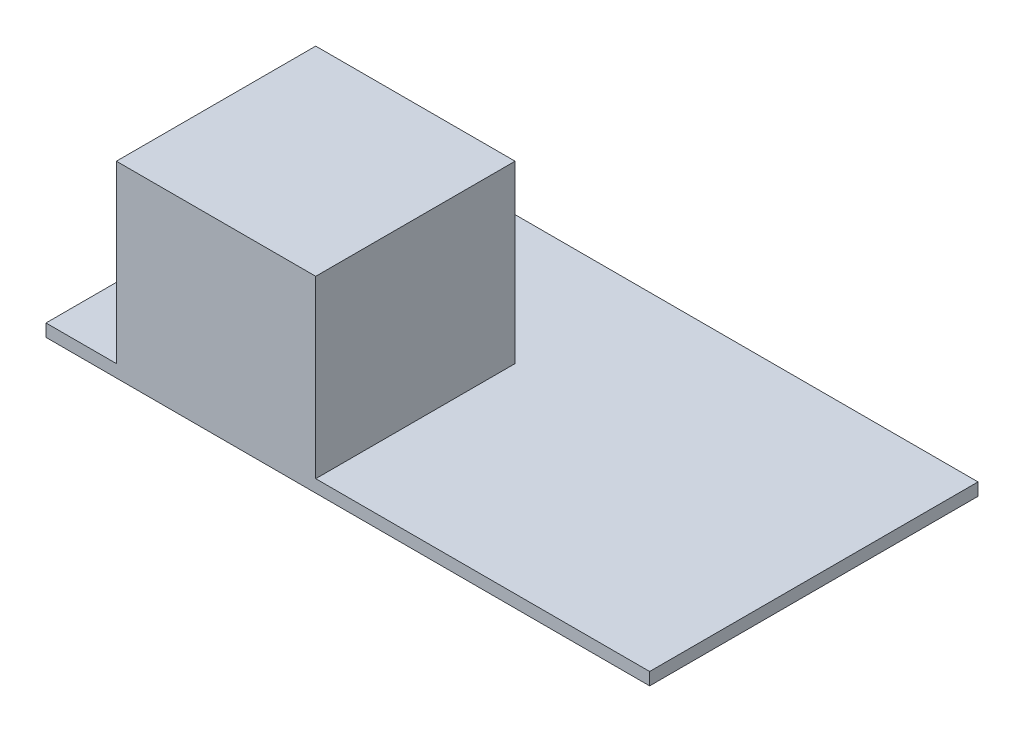
ISO-10303-21;
HEADER;
FILE_DESCRIPTION(('STEP AP214'),'2;1');
FILE_NAME('part.step','',(''),(''),'','','');
FILE_SCHEMA(('AUTOMOTIVE_DESIGN { 1 0 10303 214 1 1 1 1 }'));
ENDSEC;
DATA;
#1=APPLICATION_CONTEXT('core data for automotive mechanical design processes');
#2=APPLICATION_PROTOCOL_DEFINITION('international standard','automotive_design',2000,#1);
#3=PRODUCT_CONTEXT('',#1,'mechanical');
#4=PRODUCT('Part','Part','',(#3));
#5=PRODUCT_RELATED_PRODUCT_CATEGORY('part','',(#4));
#6=PRODUCT_DEFINITION_FORMATION('','',#4);
#7=PRODUCT_DEFINITION_CONTEXT('part definition',#1,'design');
#8=PRODUCT_DEFINITION('design','',#6,#7);
#9=PRODUCT_DEFINITION_SHAPE('','',#8);
#10=(LENGTH_UNIT() NAMED_UNIT(*) SI_UNIT(.MILLI.,.METRE.));
#11=(NAMED_UNIT(*) PLANE_ANGLE_UNIT() SI_UNIT($,.RADIAN.));
#12=(NAMED_UNIT(*) SI_UNIT($,.STERADIAN.) SOLID_ANGLE_UNIT());
#13=UNCERTAINTY_MEASURE_WITH_UNIT(LENGTH_MEASURE(1.E-05),#10,'distance_accuracy_value','');
#14=(GEOMETRIC_REPRESENTATION_CONTEXT(3) GLOBAL_UNCERTAINTY_ASSIGNED_CONTEXT((#13)) GLOBAL_UNIT_ASSIGNED_CONTEXT((#10,
#11,#12)) REPRESENTATION_CONTEXT('',''));
#15=CARTESIAN_POINT('',(0.,0.,0.));
#16=DIRECTION('',(0.,0.,1.));
#17=DIRECTION('',(1.,0.,0.));
#18=AXIS2_PLACEMENT_3D('',#15,#16,#17);
#19=CARTESIAN_POINT('',(38.605,1.6,-21.));
#20=DIRECTION('',(-1.,0.,0.));
#21=DIRECTION('',(0.,0.,1.));
#22=AXIS2_PLACEMENT_3D('',#19,#20,#21);
#23=PLANE('',#22);
#24=DIRECTION('',(0.,0.,-1.));
#25=VECTOR('',#24,1.);
#26=CARTESIAN_POINT('',(38.605,0.,-21.));
#27=LINE('',#26,#25);
#28=CARTESIAN_POINT('',(38.605,0.,21.));
#29=VERTEX_POINT('',#28);
#30=CARTESIAN_POINT('',(38.605,0.,-21.));
#31=VERTEX_POINT('',#30);
#32=EDGE_CURVE('E119',#29,#31,#27,.T.);
#33=ORIENTED_EDGE('',*,*,#32,.T.);
#34=DIRECTION('',(0.,-1.,0.));
#35=VECTOR('',#34,1.);
#36=CARTESIAN_POINT('',(38.605,1.6,-21.));
#37=LINE('',#36,#35);
#38=CARTESIAN_POINT('',(38.605,1.6,-21.));
#39=VERTEX_POINT('',#38);
#40=EDGE_CURVE('E11',#39,#31,#37,.T.);
#41=ORIENTED_EDGE('',*,*,#40,.F.);
#42=DIRECTION('',(0.,0.,-1.));
#43=VECTOR('',#42,1.);
#44=CARTESIAN_POINT('',(38.605,1.6,-21.));
#45=LINE('',#44,#43);
#46=CARTESIAN_POINT('',(38.605,1.6,21.));
#47=VERTEX_POINT('',#46);
#48=EDGE_CURVE('E128',#47,#39,#45,.T.);
#49=ORIENTED_EDGE('',*,*,#48,.F.);
#50=DIRECTION('',(0.,-1.,0.));
#51=VECTOR('',#50,1.);
#52=CARTESIAN_POINT('',(38.605,1.6,21.));
#53=LINE('',#52,#51);
#54=EDGE_CURVE('E138',#47,#29,#53,.T.);
#55=ORIENTED_EDGE('',*,*,#54,.T.);
#56=EDGE_LOOP('',(#33,#41,#49,#55));
#57=FACE_BOUND('',#56,.T.);
#58=ADVANCED_FACE('F33',(#57),#23,.F.);
#59=CARTESIAN_POINT('',(-38.605,1.6,-21.));
#60=DIRECTION('',(0.,0.,1.));
#61=DIRECTION('',(1.,0.,0.));
#62=AXIS2_PLACEMENT_3D('',#59,#60,#61);
#63=PLANE('',#62);
#64=DIRECTION('',(-1.,0.,0.));
#65=VECTOR('',#64,1.);
#66=CARTESIAN_POINT('',(-38.605,0.,-21.));
#67=LINE('',#66,#65);
#68=CARTESIAN_POINT('',(-38.605,0.,-21.));
#69=VERTEX_POINT('',#68);
#70=EDGE_CURVE('E122',#31,#69,#67,.T.);
#71=ORIENTED_EDGE('',*,*,#70,.T.);
#72=DIRECTION('',(0.,-1.,0.));
#73=VECTOR('',#72,1.);
#74=CARTESIAN_POINT('',(-38.605,1.6,-21.));
#75=LINE('',#74,#73);
#76=CARTESIAN_POINT('',(-38.605,1.6,-21.));
#77=VERTEX_POINT('',#76);
#78=EDGE_CURVE('E40',#77,#69,#75,.T.);
#79=ORIENTED_EDGE('',*,*,#78,.F.);
#80=DIRECTION('',(-1.,0.,0.));
#81=VECTOR('',#80,1.);
#82=CARTESIAN_POINT('',(-38.605,1.6,-21.));
#83=LINE('',#82,#81);
#84=EDGE_CURVE('E131',#39,#77,#83,.T.);
#85=ORIENTED_EDGE('',*,*,#84,.F.);
#86=ORIENTED_EDGE('',*,*,#40,.T.);
#87=EDGE_LOOP('',(#71,#79,#85,#86));
#88=FACE_BOUND('',#87,.T.);
#89=ADVANCED_FACE('F187',(#88),#63,.F.);
#90=CARTESIAN_POINT('',(-38.605,1.6,-21.));
#91=DIRECTION('',(1.,0.,0.));
#92=DIRECTION('',(0.,0.,-1.));
#93=AXIS2_PLACEMENT_3D('',#90,#91,#92);
#94=PLANE('',#93);
#95=DIRECTION('',(0.,0.,1.));
#96=VECTOR('',#95,1.);
#97=CARTESIAN_POINT('',(-38.605,0.,-21.));
#98=LINE('',#97,#96);
#99=CARTESIAN_POINT('',(-38.605,0.,21.));
#100=VERTEX_POINT('',#99);
#101=EDGE_CURVE('E141',#69,#100,#98,.T.);
#102=ORIENTED_EDGE('',*,*,#101,.T.);
#103=DIRECTION('',(0.,-1.,0.));
#104=VECTOR('',#103,1.);
#105=CARTESIAN_POINT('',(-38.605,1.6,21.));
#106=LINE('',#105,#104);
#107=CARTESIAN_POINT('',(-38.605,1.6,21.));
#108=VERTEX_POINT('',#107);
#109=EDGE_CURVE('E146',#108,#100,#106,.T.);
#110=ORIENTED_EDGE('',*,*,#109,.F.);
#111=DIRECTION('',(0.,0.,1.));
#112=VECTOR('',#111,1.);
#113=CARTESIAN_POINT('',(-38.605,1.6,-21.));
#114=LINE('',#113,#112);
#115=EDGE_CURVE('E134',#77,#108,#114,.T.);
#116=ORIENTED_EDGE('',*,*,#115,.F.);
#117=ORIENTED_EDGE('',*,*,#78,.T.);
#118=EDGE_LOOP('',(#102,#110,#116,#117));
#119=FACE_BOUND('',#118,.T.);
#120=ADVANCED_FACE('F153',(#119),#94,.F.);
#121=CARTESIAN_POINT('',(-38.605,1.6,21.));
#122=DIRECTION('',(0.,0.,-1.));
#123=DIRECTION('',(-1.,0.,0.));
#124=AXIS2_PLACEMENT_3D('',#121,#122,#123);
#125=PLANE('',#124);
#126=DIRECTION('',(1.,0.,0.));
#127=VECTOR('',#126,1.);
#128=CARTESIAN_POINT('',(-38.605,0.,21.));
#129=LINE('',#128,#127);
#130=EDGE_CURVE('E132',#100,#29,#129,.T.);
#131=ORIENTED_EDGE('',*,*,#130,.T.);
#132=ORIENTED_EDGE('',*,*,#54,.F.);
#133=DIRECTION('',(1.,0.,0.));
#134=VECTOR('',#133,1.);
#135=CARTESIAN_POINT('',(-38.605,1.6,21.));
#136=LINE('',#135,#134);
#137=CARTESIAN_POINT('',(-4.105,1.6,21.));
#138=VERTEX_POINT('',#137);
#139=EDGE_CURVE('E136',#138,#47,#136,.T.);
#140=ORIENTED_EDGE('',*,*,#139,.F.);
#141=DIRECTION('',(0.,-1.,0.));
#142=VECTOR('',#141,1.);
#143=CARTESIAN_POINT('',(-4.10499999999999,24.02,21.));
#144=LINE('',#143,#142);
#145=CARTESIAN_POINT('',(-4.10499999999999,24.02,21.));
#146=VERTEX_POINT('',#145);
#147=EDGE_CURVE('E103',#146,#138,#144,.T.);
#148=ORIENTED_EDGE('',*,*,#147,.F.);
#149=DIRECTION('',(1.,0.,0.));
#150=VECTOR('',#149,1.);
#151=CARTESIAN_POINT('',(-29.605,24.02,21.));
#152=LINE('',#151,#150);
#153=CARTESIAN_POINT('',(-29.605,24.02,21.));
#154=VERTEX_POINT('',#153);
#155=EDGE_CURVE('E96',#154,#146,#152,.T.);
#156=ORIENTED_EDGE('',*,*,#155,.F.);
#157=DIRECTION('',(0.,-1.,0.));
#158=VECTOR('',#157,1.);
#159=CARTESIAN_POINT('',(-29.605,24.02,21.));
#160=LINE('',#159,#158);
#161=CARTESIAN_POINT('',(-29.605,1.6,21.));
#162=VERTEX_POINT('',#161);
#163=EDGE_CURVE('E101',#154,#162,#160,.T.);
#164=ORIENTED_EDGE('',*,*,#163,.T.);
#165=EDGE_CURVE('E137',#108,#162,#136,.T.);
#166=ORIENTED_EDGE('',*,*,#165,.F.);
#167=ORIENTED_EDGE('',*,*,#109,.T.);
#168=EDGE_LOOP('',(#131,#132,#140,#148,#156,#164,#166,#167));
#169=FACE_BOUND('',#168,.T.);
#170=ADVANCED_FACE('F98',(#169),#125,.F.);
#171=CARTESIAN_POINT('',(0.,1.6,0.));
#172=DIRECTION('',(0.,1.,0.));
#173=DIRECTION('',(0.,0.,1.));
#174=AXIS2_PLACEMENT_3D('',#171,#172,#173);
#175=PLANE('',#174);
#176=DIRECTION('',(0.,0.,1.));
#177=VECTOR('',#176,1.);
#178=CARTESIAN_POINT('',(-29.605,1.6,21.));
#179=LINE('',#178,#177);
#180=CARTESIAN_POINT('',(-29.605,1.6,-4.49999999999999));
#181=VERTEX_POINT('',#180);
#182=EDGE_CURVE('E47',#181,#162,#179,.T.);
#183=ORIENTED_EDGE('',*,*,#182,.F.);
#184=DIRECTION('',(-1.,0.,0.));
#185=VECTOR('',#184,1.);
#186=CARTESIAN_POINT('',(-29.605,1.6,-4.49999999999999));
#187=LINE('',#186,#185);
#188=CARTESIAN_POINT('',(-4.10499999999999,1.6,-4.49999999999999));
#189=VERTEX_POINT('',#188);
#190=EDGE_CURVE('E116',#189,#181,#187,.T.);
#191=ORIENTED_EDGE('',*,*,#190,.F.);
#192=DIRECTION('',(0.,0.,-1.));
#193=VECTOR('',#192,1.);
#194=CARTESIAN_POINT('',(-4.10499999999999,1.6,21.));
#195=LINE('',#194,#193);
#196=EDGE_CURVE('E53',#138,#189,#195,.T.);
#197=ORIENTED_EDGE('',*,*,#196,.F.);
#198=ORIENTED_EDGE('',*,*,#139,.T.);
#199=ORIENTED_EDGE('',*,*,#48,.T.);
#200=ORIENTED_EDGE('',*,*,#84,.T.);
#201=ORIENTED_EDGE('',*,*,#115,.T.);
#202=ORIENTED_EDGE('',*,*,#165,.T.);
#203=EDGE_LOOP('',(#183,#191,#197,#198,#199,#200,#201,#202));
#204=FACE_BOUND('',#203,.T.);
#205=ADVANCED_FACE('F164',(#204),#175,.T.);
#206=CARTESIAN_POINT('',(0.,0.,0.));
#207=DIRECTION('',(0.,1.,0.));
#208=DIRECTION('',(0.,0.,1.));
#209=AXIS2_PLACEMENT_3D('',#206,#207,#208);
#210=PLANE('',#209);
#211=ORIENTED_EDGE('',*,*,#32,.F.);
#212=ORIENTED_EDGE('',*,*,#130,.F.);
#213=ORIENTED_EDGE('',*,*,#101,.F.);
#214=ORIENTED_EDGE('',*,*,#70,.F.);
#215=EDGE_LOOP('',(#211,#212,#213,#214));
#216=FACE_BOUND('',#215,.T.);
#217=ADVANCED_FACE('F159',(#216),#210,.F.);
#218=CARTESIAN_POINT('',(-29.605,24.02,21.));
#219=DIRECTION('',(1.,0.,0.));
#220=DIRECTION('',(0.,0.,-1.));
#221=AXIS2_PLACEMENT_3D('',#218,#219,#220);
#222=PLANE('',#221);
#223=ORIENTED_EDGE('',*,*,#182,.T.);
#224=ORIENTED_EDGE('',*,*,#163,.F.);
#225=DIRECTION('',(0.,0.,1.));
#226=VECTOR('',#225,1.);
#227=CARTESIAN_POINT('',(-29.605,24.02,21.));
#228=LINE('',#227,#226);
#229=CARTESIAN_POINT('',(-29.605,24.02,-4.49999999999999));
#230=VERTEX_POINT('',#229);
#231=EDGE_CURVE('E107',#230,#154,#228,.T.);
#232=ORIENTED_EDGE('',*,*,#231,.F.);
#233=DIRECTION('',(0.,-1.,0.));
#234=VECTOR('',#233,1.);
#235=CARTESIAN_POINT('',(-29.605,24.02,-4.49999999999999));
#236=LINE('',#235,#234);
#237=EDGE_CURVE('E170',#230,#181,#236,.T.);
#238=ORIENTED_EDGE('',*,*,#237,.T.);
#239=EDGE_LOOP('',(#223,#224,#232,#238));
#240=FACE_BOUND('',#239,.T.);
#241=ADVANCED_FACE('F118',(#240),#222,.F.);
#242=CARTESIAN_POINT('',(-4.10499999999999,24.02,21.));
#243=DIRECTION('',(-1.,0.,0.));
#244=DIRECTION('',(0.,0.,1.));
#245=AXIS2_PLACEMENT_3D('',#242,#243,#244);
#246=PLANE('',#245);
#247=ORIENTED_EDGE('',*,*,#196,.T.);
#248=DIRECTION('',(0.,-1.,0.));
#249=VECTOR('',#248,1.);
#250=CARTESIAN_POINT('',(-4.10499999999999,24.02,-4.49999999999999));
#251=LINE('',#250,#249);
#252=CARTESIAN_POINT('',(-4.10499999999999,24.02,-4.49999999999999));
#253=VERTEX_POINT('',#252);
#254=EDGE_CURVE('E124',#253,#189,#251,.T.);
#255=ORIENTED_EDGE('',*,*,#254,.F.);
#256=DIRECTION('',(0.,0.,-1.));
#257=VECTOR('',#256,1.);
#258=CARTESIAN_POINT('',(-4.10499999999999,24.02,21.));
#259=LINE('',#258,#257);
#260=EDGE_CURVE('E106',#146,#253,#259,.T.);
#261=ORIENTED_EDGE('',*,*,#260,.F.);
#262=ORIENTED_EDGE('',*,*,#147,.T.);
#263=EDGE_LOOP('',(#247,#255,#261,#262));
#264=FACE_BOUND('',#263,.T.);
#265=ADVANCED_FACE('F166',(#264),#246,.F.);
#266=CARTESIAN_POINT('',(-29.605,24.02,-4.49999999999999));
#267=DIRECTION('',(0.,0.,1.));
#268=DIRECTION('',(1.,0.,0.));
#269=AXIS2_PLACEMENT_3D('',#266,#267,#268);
#270=PLANE('',#269);
#271=ORIENTED_EDGE('',*,*,#190,.T.);
#272=ORIENTED_EDGE('',*,*,#237,.F.);
#273=DIRECTION('',(-1.,0.,0.));
#274=VECTOR('',#273,1.);
#275=CARTESIAN_POINT('',(-29.605,24.02,-4.49999999999999));
#276=LINE('',#275,#274);
#277=EDGE_CURVE('E112',#253,#230,#276,.T.);
#278=ORIENTED_EDGE('',*,*,#277,.F.);
#279=ORIENTED_EDGE('',*,*,#254,.T.);
#280=EDGE_LOOP('',(#271,#272,#278,#279));
#281=FACE_BOUND('',#280,.T.);
#282=ADVANCED_FACE('F177',(#281),#270,.F.);
#283=CARTESIAN_POINT('',(0.,24.02,0.));
#284=DIRECTION('',(0.,-1.,0.));
#285=DIRECTION('',(0.,0.,-1.));
#286=AXIS2_PLACEMENT_3D('',#283,#284,#285);
#287=PLANE('',#286);
#288=ORIENTED_EDGE('',*,*,#231,.T.);
#289=ORIENTED_EDGE('',*,*,#155,.T.);
#290=ORIENTED_EDGE('',*,*,#260,.T.);
#291=ORIENTED_EDGE('',*,*,#277,.T.);
#292=EDGE_LOOP('',(#288,#289,#290,#291));
#293=FACE_BOUND('',#292,.T.);
#294=ADVANCED_FACE('F110',(#293),#287,.F.);
#295=CLOSED_SHELL('',(#58,#89,#120,#170,#205,#217,#241,#265,#282,#294));
#296=MANIFOLD_SOLID_BREP('B2',#295);
#297=ADVANCED_BREP_SHAPE_REPRESENTATION('',(#18,#296),#14);
#298=SHAPE_DEFINITION_REPRESENTATION(#9,#297);
ENDSEC;
END-ISO-10303-21;
